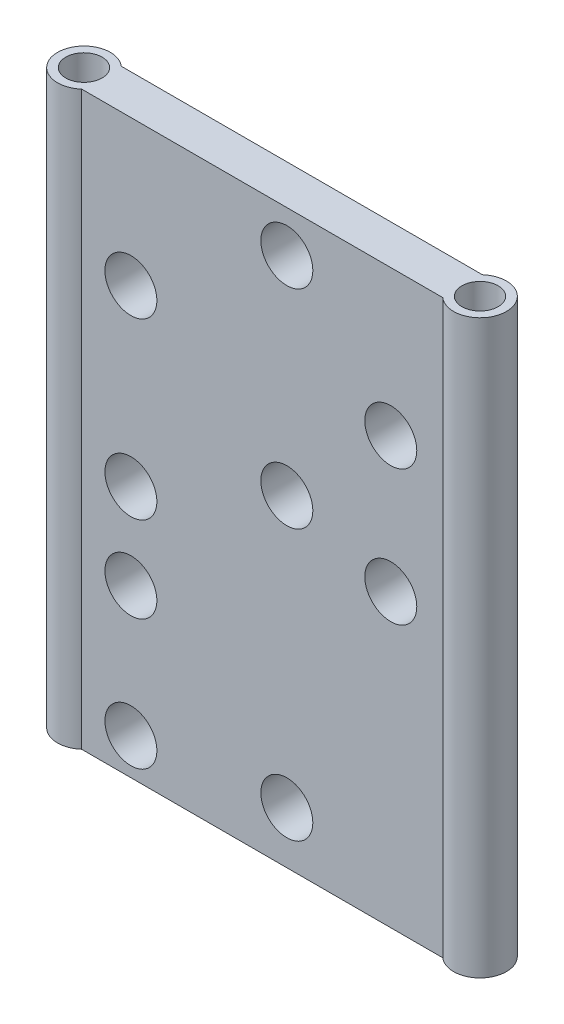
ISO-10303-21;
HEADER;
FILE_DESCRIPTION(('STEP AP214'),'2;1');
FILE_NAME('part.step','',(''),(''),'','','');
FILE_SCHEMA(('AUTOMOTIVE_DESIGN { 1 0 10303 214 1 1 1 1 }'));
ENDSEC;
DATA;
#1=APPLICATION_CONTEXT('core data for automotive mechanical design processes');
#2=APPLICATION_PROTOCOL_DEFINITION('international standard','automotive_design',2000,#1);
#3=PRODUCT_CONTEXT('',#1,'mechanical');
#4=PRODUCT('Part','Part','',(#3));
#5=PRODUCT_RELATED_PRODUCT_CATEGORY('part','',(#4));
#6=PRODUCT_DEFINITION_FORMATION('','',#4);
#7=PRODUCT_DEFINITION_CONTEXT('part definition',#1,'design');
#8=PRODUCT_DEFINITION('design','',#6,#7);
#9=PRODUCT_DEFINITION_SHAPE('','',#8);
#10=(LENGTH_UNIT() NAMED_UNIT(*) SI_UNIT(.MILLI.,.METRE.));
#11=(NAMED_UNIT(*) PLANE_ANGLE_UNIT() SI_UNIT($,.RADIAN.));
#12=(NAMED_UNIT(*) SI_UNIT($,.STERADIAN.) SOLID_ANGLE_UNIT());
#13=UNCERTAINTY_MEASURE_WITH_UNIT(LENGTH_MEASURE(1.E-05),#10,'distance_accuracy_value','');
#14=(GEOMETRIC_REPRESENTATION_CONTEXT(3) GLOBAL_UNCERTAINTY_ASSIGNED_CONTEXT((#13)) GLOBAL_UNIT_ASSIGNED_CONTEXT((#10,
#11,#12)) REPRESENTATION_CONTEXT('',''));
#15=CARTESIAN_POINT('',(0.,0.,0.));
#16=DIRECTION('',(0.,0.,1.));
#17=DIRECTION('',(1.,0.,0.));
#18=AXIS2_PLACEMENT_3D('',#15,#16,#17);
#19=CARTESIAN_POINT('',(-38.1000000000002,55.,0.));
#20=DIRECTION('',(0.,-1.,0.));
#21=DIRECTION('',(0.,0.,-1.));
#22=AXIS2_PLACEMENT_3D('',#19,#20,#21);
#23=CYLINDRICAL_SURFACE('',#22,5.08);
#24=CARTESIAN_POINT('',(-38.1000000000002,-55.,0.));
#25=DIRECTION('',(0.,1.,0.));
#26=DIRECTION('',(0.,0.,1.));
#27=AXIS2_PLACEMENT_3D('',#24,#25,#26);
#28=CIRCLE('',#27,5.08);
#29=CARTESIAN_POINT('',(-34.7398958349482,-55.,-3.80999999999999));
#30=VERTEX_POINT('',#29);
#31=CARTESIAN_POINT('',(-34.7398958349482,-55.,3.81000000000002));
#32=VERTEX_POINT('',#31);
#33=EDGE_CURVE('E126',#30,#32,#28,.T.);
#34=ORIENTED_EDGE('',*,*,#33,.T.);
#35=DIRECTION('',(0.,-1.,0.));
#36=VECTOR('',#35,1.);
#37=CARTESIAN_POINT('',(-34.7398958349482,55.,3.81000000000002));
#38=LINE('',#37,#36);
#39=CARTESIAN_POINT('',(-34.7398958349482,55.,3.81000000000002));
#40=VERTEX_POINT('',#39);
#41=EDGE_CURVE('E11',#40,#32,#38,.T.);
#42=ORIENTED_EDGE('',*,*,#41,.F.);
#43=CARTESIAN_POINT('',(-38.1000000000002,55.,0.));
#44=DIRECTION('',(0.,1.,0.));
#45=DIRECTION('',(0.,0.,1.));
#46=AXIS2_PLACEMENT_3D('',#43,#44,#45);
#47=CIRCLE('',#46,5.08);
#48=CARTESIAN_POINT('',(-34.7398958349482,55.,-3.80999999999999));
#49=VERTEX_POINT('',#48);
#50=EDGE_CURVE('E99',#49,#40,#47,.T.);
#51=ORIENTED_EDGE('',*,*,#50,.F.);
#52=DIRECTION('',(0.,-1.,0.));
#53=VECTOR('',#52,1.);
#54=CARTESIAN_POINT('',(-34.7398958349482,55.,-3.80999999999999));
#55=LINE('',#54,#53);
#56=EDGE_CURVE('E65',#49,#30,#55,.T.);
#57=ORIENTED_EDGE('',*,*,#56,.T.);
#58=EDGE_LOOP('',(#34,#42,#51,#57));
#59=FACE_BOUND('',#58,.T.);
#60=ADVANCED_FACE('F45',(#59),#23,.T.);
#61=CARTESIAN_POINT('',(0.,55.,3.81));
#62=DIRECTION('',(0.,0.,-1.));
#63=DIRECTION('',(-1.,0.,0.));
#64=AXIS2_PLACEMENT_3D('',#61,#62,#63);
#65=PLANE('',#64);
#66=CARTESIAN_POINT('',(4.73989583494777,47.,3.81));
#67=DIRECTION('',(0.,0.,1.));
#68=DIRECTION('',(1.,0.,0.));
#69=AXIS2_PLACEMENT_3D('',#66,#67,#68);
#70=CIRCLE('',#69,5.);
#71=CARTESIAN_POINT('',(9.73989583494776,47.,3.81));
#72=VERTEX_POINT('',#71);
#73=EDGE_CURVE('E152',#72,#72,#70,.T.);
#74=ORIENTED_EDGE('',*,*,#73,.F.);
#75=EDGE_LOOP('',(#74));
#76=FACE_BOUND('',#75,.T.);
#77=CARTESIAN_POINT('',(-25.2601041650522,-23.,3.81));
#78=DIRECTION('',(0.,0.,1.));
#79=DIRECTION('',(1.,0.,0.));
#80=AXIS2_PLACEMENT_3D('',#77,#78,#79);
#81=CIRCLE('',#80,5.);
#82=CARTESIAN_POINT('',(-20.2601041650522,-23.,3.81));
#83=VERTEX_POINT('',#82);
#84=EDGE_CURVE('E226',#83,#83,#81,.T.);
#85=ORIENTED_EDGE('',*,*,#84,.F.);
#86=EDGE_LOOP('',(#85));
#87=FACE_BOUND('',#86,.T.);
#88=CARTESIAN_POINT('',(-25.2601041650522,27.,3.81));
#89=DIRECTION('',(0.,0.,1.));
#90=DIRECTION('',(1.,0.,0.));
#91=AXIS2_PLACEMENT_3D('',#88,#89,#90);
#92=CIRCLE('',#91,5.);
#93=CARTESIAN_POINT('',(-20.2601041650522,27.,3.81));
#94=VERTEX_POINT('',#93);
#95=EDGE_CURVE('E230',#94,#94,#92,.T.);
#96=ORIENTED_EDGE('',*,*,#95,.F.);
#97=EDGE_LOOP('',(#96));
#98=FACE_BOUND('',#97,.T.);
#99=CARTESIAN_POINT('',(24.7398958349478,27.,3.81));
#100=DIRECTION('',(0.,0.,1.));
#101=DIRECTION('',(1.,0.,0.));
#102=AXIS2_PLACEMENT_3D('',#99,#100,#101);
#103=CIRCLE('',#102,5.);
#104=CARTESIAN_POINT('',(29.7398958349478,27.,3.81));
#105=VERTEX_POINT('',#104);
#106=EDGE_CURVE('E234',#105,#105,#103,.T.);
#107=ORIENTED_EDGE('',*,*,#106,.F.);
#108=EDGE_LOOP('',(#107));
#109=FACE_BOUND('',#108,.T.);
#110=CARTESIAN_POINT('',(-25.2601041650522,-6.49999999999998,3.81));
#111=DIRECTION('',(0.,0.,1.));
#112=DIRECTION('',(1.,0.,0.));
#113=AXIS2_PLACEMENT_3D('',#110,#111,#112);
#114=CIRCLE('',#113,5.);
#115=CARTESIAN_POINT('',(-20.2601041650522,-6.49999999999998,3.81));
#116=VERTEX_POINT('',#115);
#117=EDGE_CURVE('E238',#116,#116,#114,.T.);
#118=ORIENTED_EDGE('',*,*,#117,.F.);
#119=EDGE_LOOP('',(#118));
#120=FACE_BOUND('',#119,.T.);
#121=CARTESIAN_POINT('',(4.73989583494776,7.,3.81));
#122=DIRECTION('',(0.,0.,1.));
#123=DIRECTION('',(1.,0.,0.));
#124=AXIS2_PLACEMENT_3D('',#121,#122,#123);
#125=CIRCLE('',#124,5.);
#126=CARTESIAN_POINT('',(9.73989583494776,7.,3.81));
#127=VERTEX_POINT('',#126);
#128=EDGE_CURVE('E217',#127,#127,#125,.T.);
#129=ORIENTED_EDGE('',*,*,#128,.F.);
#130=EDGE_LOOP('',(#129));
#131=FACE_BOUND('',#130,.T.);
#132=CARTESIAN_POINT('',(4.73989583494777,-45.,3.81));
#133=DIRECTION('',(0.,0.,1.));
#134=DIRECTION('',(1.,0.,0.));
#135=AXIS2_PLACEMENT_3D('',#132,#133,#134);
#136=CIRCLE('',#135,5.);
#137=CARTESIAN_POINT('',(9.73989583494776,-45.,3.81));
#138=VERTEX_POINT('',#137);
#139=EDGE_CURVE('E213',#138,#138,#136,.T.);
#140=ORIENTED_EDGE('',*,*,#139,.F.);
#141=EDGE_LOOP('',(#140));
#142=FACE_BOUND('',#141,.T.);
#143=CARTESIAN_POINT('',(24.7398958349478,1.,3.81));
#144=DIRECTION('',(0.,0.,1.));
#145=DIRECTION('',(1.,0.,0.));
#146=AXIS2_PLACEMENT_3D('',#143,#144,#145);
#147=CIRCLE('',#146,5.);
#148=CARTESIAN_POINT('',(29.7398958349478,1.,3.81));
#149=VERTEX_POINT('',#148);
#150=EDGE_CURVE('E218',#149,#149,#147,.T.);
#151=ORIENTED_EDGE('',*,*,#150,.F.);
#152=EDGE_LOOP('',(#151));
#153=FACE_BOUND('',#152,.T.);
#154=CARTESIAN_POINT('',(-25.2601041650522,-48.,3.81));
#155=DIRECTION('',(0.,0.,1.));
#156=DIRECTION('',(1.,0.,0.));
#157=AXIS2_PLACEMENT_3D('',#154,#155,#156);
#158=CIRCLE('',#157,5.);
#159=CARTESIAN_POINT('',(-20.2601041650522,-48.,3.81));
#160=VERTEX_POINT('',#159);
#161=EDGE_CURVE('E222',#160,#160,#158,.T.);
#162=ORIENTED_EDGE('',*,*,#161,.F.);
#163=EDGE_LOOP('',(#162));
#164=FACE_BOUND('',#163,.T.);
#165=DIRECTION('',(1.,0.,0.));
#166=VECTOR('',#165,1.);
#167=CARTESIAN_POINT('',(0.,-55.,3.81));
#168=LINE('',#167,#166);
#169=CARTESIAN_POINT('',(34.7398958349478,-55.,3.80999999999999));
#170=VERTEX_POINT('',#169);
#171=EDGE_CURVE('E105',#32,#170,#168,.T.);
#172=ORIENTED_EDGE('',*,*,#171,.T.);
#173=DIRECTION('',(0.,-1.,0.));
#174=VECTOR('',#173,1.);
#175=CARTESIAN_POINT('',(34.7398958349478,55.,3.80999999999999));
#176=LINE('',#175,#174);
#177=CARTESIAN_POINT('',(34.7398958349478,55.,3.80999999999999));
#178=VERTEX_POINT('',#177);
#179=EDGE_CURVE('E56',#178,#170,#176,.T.);
#180=ORIENTED_EDGE('',*,*,#179,.F.);
#181=DIRECTION('',(1.,0.,0.));
#182=VECTOR('',#181,1.);
#183=CARTESIAN_POINT('',(0.,55.,3.81));
#184=LINE('',#183,#182);
#185=EDGE_CURVE('E91',#40,#178,#184,.T.);
#186=ORIENTED_EDGE('',*,*,#185,.F.);
#187=ORIENTED_EDGE('',*,*,#41,.T.);
#188=EDGE_LOOP('',(#172,#180,#186,#187));
#189=FACE_BOUND('',#188,.T.);
#190=ADVANCED_FACE('F104',(#76,#87,#98,#109,#120,#131,#142,#153,#164,#189),#65,.F.);
#191=CARTESIAN_POINT('',(38.0999999999998,55.,0.));
#192=DIRECTION('',(0.,-1.,0.));
#193=DIRECTION('',(0.,0.,-1.));
#194=AXIS2_PLACEMENT_3D('',#191,#192,#193);
#195=CYLINDRICAL_SURFACE('',#194,5.08);
#196=CARTESIAN_POINT('',(38.0999999999998,-55.,0.));
#197=DIRECTION('',(0.,1.,0.));
#198=DIRECTION('',(0.,0.,1.));
#199=AXIS2_PLACEMENT_3D('',#196,#197,#198);
#200=CIRCLE('',#199,5.08);
#201=CARTESIAN_POINT('',(34.7398958349478,-55.,-3.80999999999998));
#202=VERTEX_POINT('',#201);
#203=EDGE_CURVE('E131',#170,#202,#200,.T.);
#204=ORIENTED_EDGE('',*,*,#203,.T.);
#205=DIRECTION('',(0.,-1.,0.));
#206=VECTOR('',#205,1.);
#207=CARTESIAN_POINT('',(34.7398958349478,55.,-3.80999999999998));
#208=LINE('',#207,#206);
#209=CARTESIAN_POINT('',(34.7398958349478,55.,-3.80999999999998));
#210=VERTEX_POINT('',#209);
#211=EDGE_CURVE('E80',#210,#202,#208,.T.);
#212=ORIENTED_EDGE('',*,*,#211,.F.);
#213=CARTESIAN_POINT('',(38.0999999999998,55.,0.));
#214=DIRECTION('',(0.,1.,0.));
#215=DIRECTION('',(0.,0.,1.));
#216=AXIS2_PLACEMENT_3D('',#213,#214,#215);
#217=CIRCLE('',#216,5.08);
#218=EDGE_CURVE('E98',#178,#210,#217,.T.);
#219=ORIENTED_EDGE('',*,*,#218,.F.);
#220=ORIENTED_EDGE('',*,*,#179,.T.);
#221=EDGE_LOOP('',(#204,#212,#219,#220));
#222=FACE_BOUND('',#221,.T.);
#223=ADVANCED_FACE('F110',(#222),#195,.T.);
#224=CARTESIAN_POINT('',(0.,55.,-3.80999999999998));
#225=DIRECTION('',(0.,0.,-1.));
#226=DIRECTION('',(-1.,0.,0.));
#227=AXIS2_PLACEMENT_3D('',#224,#225,#226);
#228=PLANE('',#227);
#229=CARTESIAN_POINT('',(4.73989583494777,47.,-3.80999999999998));
#230=DIRECTION('',(0.,0.,-1.));
#231=DIRECTION('',(-1.,0.,0.));
#232=AXIS2_PLACEMENT_3D('',#229,#230,#231);
#233=CIRCLE('',#232,5.);
#234=CARTESIAN_POINT('',(-0.26010416505223,47.,-3.80999999999998));
#235=VERTEX_POINT('',#234);
#236=EDGE_CURVE('E49',#235,#235,#233,.T.);
#237=ORIENTED_EDGE('',*,*,#236,.F.);
#238=EDGE_LOOP('',(#237));
#239=FACE_BOUND('',#238,.T.);
#240=CARTESIAN_POINT('',(-25.2601041650522,-23.,-3.80999999999998));
#241=DIRECTION('',(0.,0.,-1.));
#242=DIRECTION('',(-1.,0.,0.));
#243=AXIS2_PLACEMENT_3D('',#240,#241,#242);
#244=CIRCLE('',#243,5.);
#245=CARTESIAN_POINT('',(-30.2601041650522,-23.,-3.80999999999998));
#246=VERTEX_POINT('',#245);
#247=EDGE_CURVE('E175',#246,#246,#244,.T.);
#248=ORIENTED_EDGE('',*,*,#247,.F.);
#249=EDGE_LOOP('',(#248));
#250=FACE_BOUND('',#249,.T.);
#251=CARTESIAN_POINT('',(-25.2601041650522,27.,-3.80999999999998));
#252=DIRECTION('',(0.,0.,-1.));
#253=DIRECTION('',(-1.,0.,0.));
#254=AXIS2_PLACEMENT_3D('',#251,#252,#253);
#255=CIRCLE('',#254,5.);
#256=CARTESIAN_POINT('',(-30.2601041650522,27.,-3.80999999999998));
#257=VERTEX_POINT('',#256);
#258=EDGE_CURVE('E172',#257,#257,#255,.T.);
#259=ORIENTED_EDGE('',*,*,#258,.F.);
#260=EDGE_LOOP('',(#259));
#261=FACE_BOUND('',#260,.T.);
#262=CARTESIAN_POINT('',(24.7398958349478,27.,-3.80999999999998));
#263=DIRECTION('',(0.,0.,-1.));
#264=DIRECTION('',(-1.,0.,0.));
#265=AXIS2_PLACEMENT_3D('',#262,#263,#264);
#266=CIRCLE('',#265,5.);
#267=CARTESIAN_POINT('',(19.7398958349478,27.,-3.80999999999998));
#268=VERTEX_POINT('',#267);
#269=EDGE_CURVE('E168',#268,#268,#266,.T.);
#270=ORIENTED_EDGE('',*,*,#269,.F.);
#271=EDGE_LOOP('',(#270));
#272=FACE_BOUND('',#271,.T.);
#273=CARTESIAN_POINT('',(-25.2601041650522,-6.49999999999998,-3.80999999999998));
#274=DIRECTION('',(0.,0.,-1.));
#275=DIRECTION('',(-1.,0.,0.));
#276=AXIS2_PLACEMENT_3D('',#273,#274,#275);
#277=CIRCLE('',#276,5.);
#278=CARTESIAN_POINT('',(-30.2601041650522,-6.49999999999998,-3.80999999999998));
#279=VERTEX_POINT('',#278);
#280=EDGE_CURVE('E164',#279,#279,#277,.T.);
#281=ORIENTED_EDGE('',*,*,#280,.F.);
#282=EDGE_LOOP('',(#281));
#283=FACE_BOUND('',#282,.T.);
#284=CARTESIAN_POINT('',(4.73989583494776,7.,-3.80999999999998));
#285=DIRECTION('',(0.,0.,-1.));
#286=DIRECTION('',(-1.,0.,0.));
#287=AXIS2_PLACEMENT_3D('',#284,#285,#286);
#288=CIRCLE('',#287,5.);
#289=CARTESIAN_POINT('',(-0.260104165052236,7.,-3.80999999999998));
#290=VERTEX_POINT('',#289);
#291=EDGE_CURVE('E160',#290,#290,#288,.T.);
#292=ORIENTED_EDGE('',*,*,#291,.F.);
#293=EDGE_LOOP('',(#292));
#294=FACE_BOUND('',#293,.T.);
#295=CARTESIAN_POINT('',(4.73989583494777,-45.,-3.80999999999998));
#296=DIRECTION('',(0.,0.,-1.));
#297=DIRECTION('',(-1.,0.,0.));
#298=AXIS2_PLACEMENT_3D('',#295,#296,#297);
#299=CIRCLE('',#298,5.);
#300=CARTESIAN_POINT('',(-0.260104165052234,-45.,-3.80999999999998));
#301=VERTEX_POINT('',#300);
#302=EDGE_CURVE('E156',#301,#301,#299,.T.);
#303=ORIENTED_EDGE('',*,*,#302,.F.);
#304=EDGE_LOOP('',(#303));
#305=FACE_BOUND('',#304,.T.);
#306=CARTESIAN_POINT('',(24.7398958349478,1.,-3.80999999999998));
#307=DIRECTION('',(0.,0.,-1.));
#308=DIRECTION('',(-1.,0.,0.));
#309=AXIS2_PLACEMENT_3D('',#306,#307,#308);
#310=CIRCLE('',#309,5.);
#311=CARTESIAN_POINT('',(19.7398958349478,1.,-3.80999999999998));
#312=VERTEX_POINT('',#311);
#313=EDGE_CURVE('E151',#312,#312,#310,.T.);
#314=ORIENTED_EDGE('',*,*,#313,.F.);
#315=EDGE_LOOP('',(#314));
#316=FACE_BOUND('',#315,.T.);
#317=CARTESIAN_POINT('',(-25.2601041650522,-48.,-3.80999999999998));
#318=DIRECTION('',(0.,0.,-1.));
#319=DIRECTION('',(-1.,0.,0.));
#320=AXIS2_PLACEMENT_3D('',#317,#318,#319);
#321=CIRCLE('',#320,5.);
#322=CARTESIAN_POINT('',(-30.2601041650522,-48.,-3.80999999999998));
#323=VERTEX_POINT('',#322);
#324=EDGE_CURVE('E147',#323,#323,#321,.T.);
#325=ORIENTED_EDGE('',*,*,#324,.F.);
#326=EDGE_LOOP('',(#325));
#327=FACE_BOUND('',#326,.T.);
#328=DIRECTION('',(1.,0.,0.));
#329=VECTOR('',#328,1.);
#330=CARTESIAN_POINT('',(0.,-55.,-3.80999999999998));
#331=LINE('',#330,#329);
#332=EDGE_CURVE('E134',#30,#202,#331,.T.);
#333=ORIENTED_EDGE('',*,*,#332,.F.);
#334=ORIENTED_EDGE('',*,*,#56,.F.);
#335=DIRECTION('',(1.,0.,0.));
#336=VECTOR('',#335,1.);
#337=CARTESIAN_POINT('',(0.,55.,-3.80999999999998));
#338=LINE('',#337,#336);
#339=EDGE_CURVE('E112',#49,#210,#338,.T.);
#340=ORIENTED_EDGE('',*,*,#339,.T.);
#341=ORIENTED_EDGE('',*,*,#211,.T.);
#342=EDGE_LOOP('',(#333,#334,#340,#341));
#343=FACE_BOUND('',#342,.T.);
#344=ADVANCED_FACE('F187',(#239,#250,#261,#272,#283,#294,#305,#316,#327,#343),#228,.T.);
#345=CARTESIAN_POINT('',(38.0999999999998,55.,0.));
#346=DIRECTION('',(0.,-1.,0.));
#347=DIRECTION('',(0.,0.,-1.));
#348=AXIS2_PLACEMENT_3D('',#345,#346,#347);
#349=CYLINDRICAL_SURFACE('',#348,3.4925);
#350=CARTESIAN_POINT('',(38.0999999999998,55.,0.));
#351=DIRECTION('',(0.,1.,0.));
#352=DIRECTION('',(0.,0.,1.));
#353=AXIS2_PLACEMENT_3D('',#350,#351,#352);
#354=CIRCLE('',#353,3.4925);
#355=CARTESIAN_POINT('',(38.0999999999998,55.,3.4925));
#356=VERTEX_POINT('',#355);
#357=EDGE_CURVE('E142',#356,#356,#354,.T.);
#358=ORIENTED_EDGE('',*,*,#357,.T.);
#359=EDGE_LOOP('',(#358));
#360=FACE_BOUND('',#359,.T.);
#361=CARTESIAN_POINT('',(38.0999999999998,-55.,0.));
#362=DIRECTION('',(0.,1.,0.));
#363=DIRECTION('',(0.,0.,1.));
#364=AXIS2_PLACEMENT_3D('',#361,#362,#363);
#365=CIRCLE('',#364,3.4925);
#366=CARTESIAN_POINT('',(38.0999999999998,-55.,3.4925));
#367=VERTEX_POINT('',#366);
#368=EDGE_CURVE('E122',#367,#367,#365,.T.);
#369=ORIENTED_EDGE('',*,*,#368,.F.);
#370=EDGE_LOOP('',(#369));
#371=FACE_BOUND('',#370,.T.);
#372=ADVANCED_FACE('F47',(#360,#371),#349,.F.);
#373=CARTESIAN_POINT('',(-38.1000000000002,55.,0.));
#374=DIRECTION('',(0.,-1.,0.));
#375=DIRECTION('',(0.,0.,-1.));
#376=AXIS2_PLACEMENT_3D('',#373,#374,#375);
#377=CYLINDRICAL_SURFACE('',#376,3.49250000000001);
#378=CARTESIAN_POINT('',(-38.1000000000002,55.,0.));
#379=DIRECTION('',(0.,1.,0.));
#380=DIRECTION('',(0.,0.,1.));
#381=AXIS2_PLACEMENT_3D('',#378,#379,#380);
#382=CIRCLE('',#381,3.49250000000001);
#383=CARTESIAN_POINT('',(-38.1000000000002,55.,3.49250000000003));
#384=VERTEX_POINT('',#383);
#385=EDGE_CURVE('E115',#384,#384,#382,.T.);
#386=ORIENTED_EDGE('',*,*,#385,.T.);
#387=EDGE_LOOP('',(#386));
#388=FACE_BOUND('',#387,.T.);
#389=CARTESIAN_POINT('',(-38.1000000000002,-55.,0.));
#390=DIRECTION('',(0.,1.,0.));
#391=DIRECTION('',(0.,0.,1.));
#392=AXIS2_PLACEMENT_3D('',#389,#390,#391);
#393=CIRCLE('',#392,3.49250000000001);
#394=CARTESIAN_POINT('',(-38.1000000000002,-55.,3.49250000000003));
#395=VERTEX_POINT('',#394);
#396=EDGE_CURVE('E138',#395,#395,#393,.T.);
#397=ORIENTED_EDGE('',*,*,#396,.F.);
#398=EDGE_LOOP('',(#397));
#399=FACE_BOUND('',#398,.T.);
#400=ADVANCED_FACE('F289',(#388,#399),#377,.F.);
#401=CARTESIAN_POINT('',(0.,55.,0.));
#402=DIRECTION('',(0.,1.,0.));
#403=DIRECTION('',(0.,0.,1.));
#404=AXIS2_PLACEMENT_3D('',#401,#402,#403);
#405=PLANE('',#404);
#406=ORIENTED_EDGE('',*,*,#357,.F.);
#407=EDGE_LOOP('',(#406));
#408=FACE_BOUND('',#407,.T.);
#409=ORIENTED_EDGE('',*,*,#50,.T.);
#410=ORIENTED_EDGE('',*,*,#185,.T.);
#411=ORIENTED_EDGE('',*,*,#218,.T.);
#412=ORIENTED_EDGE('',*,*,#339,.F.);
#413=EDGE_LOOP('',(#409,#410,#411,#412));
#414=FACE_BOUND('',#413,.T.);
#415=ORIENTED_EDGE('',*,*,#385,.F.);
#416=EDGE_LOOP('',(#415));
#417=FACE_BOUND('',#416,.T.);
#418=ADVANCED_FACE('F94',(#408,#414,#417),#405,.T.);
#419=CARTESIAN_POINT('',(0.,-55.,0.));
#420=DIRECTION('',(0.,1.,0.));
#421=DIRECTION('',(0.,0.,1.));
#422=AXIS2_PLACEMENT_3D('',#419,#420,#421);
#423=PLANE('',#422);
#424=ORIENTED_EDGE('',*,*,#368,.T.);
#425=EDGE_LOOP('',(#424));
#426=FACE_BOUND('',#425,.T.);
#427=ORIENTED_EDGE('',*,*,#33,.F.);
#428=ORIENTED_EDGE('',*,*,#332,.T.);
#429=ORIENTED_EDGE('',*,*,#203,.F.);
#430=ORIENTED_EDGE('',*,*,#171,.F.);
#431=EDGE_LOOP('',(#427,#428,#429,#430));
#432=FACE_BOUND('',#431,.T.);
#433=ORIENTED_EDGE('',*,*,#396,.T.);
#434=EDGE_LOOP('',(#433));
#435=FACE_BOUND('',#434,.T.);
#436=ADVANCED_FACE('F206',(#426,#432,#435),#423,.F.);
#437=CARTESIAN_POINT('',(-25.2601041650522,-48.,-5.07999999999999));
#438=DIRECTION('',(0.,0.,1.));
#439=DIRECTION('',(1.,0.,0.));
#440=AXIS2_PLACEMENT_3D('',#437,#438,#439);
#441=CYLINDRICAL_SURFACE('',#440,5.);
#442=ORIENTED_EDGE('',*,*,#324,.T.);
#443=EDGE_LOOP('',(#442));
#444=FACE_BOUND('',#443,.T.);
#445=ORIENTED_EDGE('',*,*,#161,.T.);
#446=EDGE_LOOP('',(#445));
#447=FACE_BOUND('',#446,.T.);
#448=ADVANCED_FACE('F268',(#444,#447),#441,.F.);
#449=CARTESIAN_POINT('',(24.7398958349478,1.,-5.07999999999999));
#450=DIRECTION('',(0.,0.,1.));
#451=DIRECTION('',(1.,0.,0.));
#452=AXIS2_PLACEMENT_3D('',#449,#450,#451);
#453=CYLINDRICAL_SURFACE('',#452,5.);
#454=ORIENTED_EDGE('',*,*,#313,.T.);
#455=EDGE_LOOP('',(#454));
#456=FACE_BOUND('',#455,.T.);
#457=ORIENTED_EDGE('',*,*,#150,.T.);
#458=EDGE_LOOP('',(#457));
#459=FACE_BOUND('',#458,.T.);
#460=ADVANCED_FACE('F270',(#456,#459),#453,.F.);
#461=CARTESIAN_POINT('',(4.73989583494777,-45.,-5.07999999999999));
#462=DIRECTION('',(0.,0.,1.));
#463=DIRECTION('',(1.,0.,0.));
#464=AXIS2_PLACEMENT_3D('',#461,#462,#463);
#465=CYLINDRICAL_SURFACE('',#464,5.);
#466=ORIENTED_EDGE('',*,*,#302,.T.);
#467=EDGE_LOOP('',(#466));
#468=FACE_BOUND('',#467,.T.);
#469=ORIENTED_EDGE('',*,*,#139,.T.);
#470=EDGE_LOOP('',(#469));
#471=FACE_BOUND('',#470,.T.);
#472=ADVANCED_FACE('F277',(#468,#471),#465,.F.);
#473=CARTESIAN_POINT('',(4.73989583494776,7.,-5.07999999999999));
#474=DIRECTION('',(0.,0.,1.));
#475=DIRECTION('',(1.,0.,0.));
#476=AXIS2_PLACEMENT_3D('',#473,#474,#475);
#477=CYLINDRICAL_SURFACE('',#476,5.);
#478=ORIENTED_EDGE('',*,*,#291,.T.);
#479=EDGE_LOOP('',(#478));
#480=FACE_BOUND('',#479,.T.);
#481=ORIENTED_EDGE('',*,*,#128,.T.);
#482=EDGE_LOOP('',(#481));
#483=FACE_BOUND('',#482,.T.);
#484=ADVANCED_FACE('F297',(#480,#483),#477,.F.);
#485=CARTESIAN_POINT('',(-25.2601041650522,-6.49999999999998,-5.07999999999999));
#486=DIRECTION('',(0.,0.,1.));
#487=DIRECTION('',(1.,0.,0.));
#488=AXIS2_PLACEMENT_3D('',#485,#486,#487);
#489=CYLINDRICAL_SURFACE('',#488,5.);
#490=ORIENTED_EDGE('',*,*,#280,.T.);
#491=EDGE_LOOP('',(#490));
#492=FACE_BOUND('',#491,.T.);
#493=ORIENTED_EDGE('',*,*,#117,.T.);
#494=EDGE_LOOP('',(#493));
#495=FACE_BOUND('',#494,.T.);
#496=ADVANCED_FACE('F300',(#492,#495),#489,.F.);
#497=CARTESIAN_POINT('',(24.7398958349478,27.,-5.07999999999999));
#498=DIRECTION('',(0.,0.,1.));
#499=DIRECTION('',(1.,0.,0.));
#500=AXIS2_PLACEMENT_3D('',#497,#498,#499);
#501=CYLINDRICAL_SURFACE('',#500,5.);
#502=ORIENTED_EDGE('',*,*,#269,.T.);
#503=EDGE_LOOP('',(#502));
#504=FACE_BOUND('',#503,.T.);
#505=ORIENTED_EDGE('',*,*,#106,.T.);
#506=EDGE_LOOP('',(#505));
#507=FACE_BOUND('',#506,.T.);
#508=ADVANCED_FACE('F305',(#504,#507),#501,.F.);
#509=CARTESIAN_POINT('',(-25.2601041650522,27.,-5.07999999999999));
#510=DIRECTION('',(0.,0.,1.));
#511=DIRECTION('',(1.,0.,0.));
#512=AXIS2_PLACEMENT_3D('',#509,#510,#511);
#513=CYLINDRICAL_SURFACE('',#512,5.);
#514=ORIENTED_EDGE('',*,*,#258,.T.);
#515=EDGE_LOOP('',(#514));
#516=FACE_BOUND('',#515,.T.);
#517=ORIENTED_EDGE('',*,*,#95,.T.);
#518=EDGE_LOOP('',(#517));
#519=FACE_BOUND('',#518,.T.);
#520=ADVANCED_FACE('F312',(#516,#519),#513,.F.);
#521=CARTESIAN_POINT('',(-25.2601041650522,-23.,-5.07999999999999));
#522=DIRECTION('',(0.,0.,1.));
#523=DIRECTION('',(1.,0.,0.));
#524=AXIS2_PLACEMENT_3D('',#521,#522,#523);
#525=CYLINDRICAL_SURFACE('',#524,5.);
#526=ORIENTED_EDGE('',*,*,#247,.T.);
#527=EDGE_LOOP('',(#526));
#528=FACE_BOUND('',#527,.T.);
#529=ORIENTED_EDGE('',*,*,#84,.T.);
#530=EDGE_LOOP('',(#529));
#531=FACE_BOUND('',#530,.T.);
#532=ADVANCED_FACE('F318',(#528,#531),#525,.F.);
#533=CARTESIAN_POINT('',(4.73989583494777,47.,-5.07999999999999));
#534=DIRECTION('',(0.,0.,1.));
#535=DIRECTION('',(1.,0.,0.));
#536=AXIS2_PLACEMENT_3D('',#533,#534,#535);
#537=CYLINDRICAL_SURFACE('',#536,5.);
#538=ORIENTED_EDGE('',*,*,#236,.T.);
#539=EDGE_LOOP('',(#538));
#540=FACE_BOUND('',#539,.T.);
#541=ORIENTED_EDGE('',*,*,#73,.T.);
#542=EDGE_LOOP('',(#541));
#543=FACE_BOUND('',#542,.T.);
#544=ADVANCED_FACE('F184',(#540,#543),#537,.F.);
#545=CLOSED_SHELL('',(#60,#190,#223,#344,#372,#400,#418,#436,#448,#460,#472,#484,#496,#508,#520,
#532,#544));
#546=MANIFOLD_SOLID_BREP('B2',#545);
#547=ADVANCED_BREP_SHAPE_REPRESENTATION('',(#18,#546),#14);
#548=SHAPE_DEFINITION_REPRESENTATION(#9,#547);
ENDSEC;
END-ISO-10303-21;
